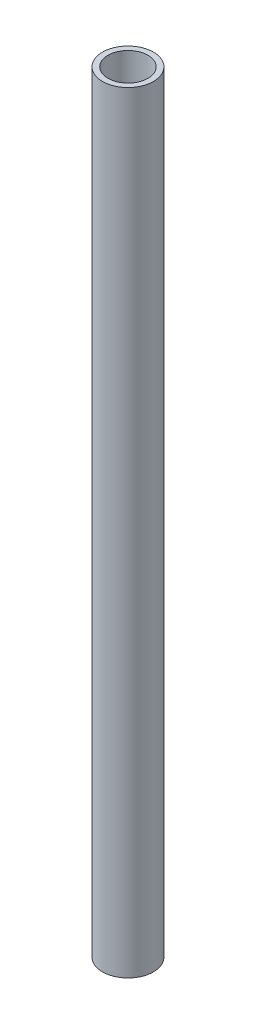
ISO-10303-21;
HEADER;
FILE_DESCRIPTION(('STEP AP214'),'2;1');
FILE_NAME('part.step','',(''),(''),'','','');
FILE_SCHEMA(('AUTOMOTIVE_DESIGN { 1 0 10303 214 1 1 1 1 }'));
ENDSEC;
DATA;
#1=APPLICATION_CONTEXT('core data for automotive mechanical design processes');
#2=APPLICATION_PROTOCOL_DEFINITION('international standard','automotive_design',2000,#1);
#3=PRODUCT_CONTEXT('',#1,'mechanical');
#4=PRODUCT('Part','Part','',(#3));
#5=PRODUCT_RELATED_PRODUCT_CATEGORY('part','',(#4));
#6=PRODUCT_DEFINITION_FORMATION('','',#4);
#7=PRODUCT_DEFINITION_CONTEXT('part definition',#1,'design');
#8=PRODUCT_DEFINITION('design','',#6,#7);
#9=PRODUCT_DEFINITION_SHAPE('','',#8);
#10=(LENGTH_UNIT() NAMED_UNIT(*) SI_UNIT(.MILLI.,.METRE.));
#11=(NAMED_UNIT(*) PLANE_ANGLE_UNIT() SI_UNIT($,.RADIAN.));
#12=(NAMED_UNIT(*) SI_UNIT($,.STERADIAN.) SOLID_ANGLE_UNIT());
#13=UNCERTAINTY_MEASURE_WITH_UNIT(LENGTH_MEASURE(1.E-05),#10,'distance_accuracy_value','');
#14=(GEOMETRIC_REPRESENTATION_CONTEXT(3) GLOBAL_UNCERTAINTY_ASSIGNED_CONTEXT((#13)) GLOBAL_UNIT_ASSIGNED_CONTEXT((#10,
#11,#12)) REPRESENTATION_CONTEXT('',''));
#15=CARTESIAN_POINT('',(0.,0.,0.));
#16=DIRECTION('',(0.,0.,1.));
#17=DIRECTION('',(1.,0.,0.));
#18=AXIS2_PLACEMENT_3D('',#15,#16,#17);
#19=CARTESIAN_POINT('',(0.,508.,0.));
#20=DIRECTION('',(0.,1.,0.));
#21=DIRECTION('',(0.,0.,1.));
#22=AXIS2_PLACEMENT_3D('',#19,#20,#21);
#23=PLANE('',#22);
#24=CARTESIAN_POINT('',(0.,508.,0.));
#25=DIRECTION('',(0.,1.,0.));
#26=DIRECTION('',(0.,0.,1.));
#27=AXIS2_PLACEMENT_3D('',#24,#25,#26);
#28=CIRCLE('',#27,16.764);
#29=CARTESIAN_POINT('',(0.,508.,16.764));
#30=VERTEX_POINT('',#29);
#31=EDGE_CURVE('E10',#30,#30,#28,.T.);
#32=ORIENTED_EDGE('',*,*,#31,.T.);
#33=EDGE_LOOP('',(#32));
#34=FACE_BOUND('',#33,.T.);
#35=CARTESIAN_POINT('',(0.,508.,0.));
#36=DIRECTION('',(0.,1.,0.));
#37=DIRECTION('',(0.,0.,1.));
#38=AXIS2_PLACEMENT_3D('',#35,#36,#37);
#39=CIRCLE('',#38,13.17625);
#40=CARTESIAN_POINT('',(0.,508.,13.17625));
#41=VERTEX_POINT('',#40);
#42=EDGE_CURVE('E52',#41,#41,#39,.T.);
#43=ORIENTED_EDGE('',*,*,#42,.F.);
#44=EDGE_LOOP('',(#43));
#45=FACE_BOUND('',#44,.T.);
#46=ADVANCED_FACE('F39',(#34,#45),#23,.T.);
#47=CARTESIAN_POINT('',(0.,0.,0.));
#48=DIRECTION('',(0.,1.,0.));
#49=DIRECTION('',(0.,0.,1.));
#50=AXIS2_PLACEMENT_3D('',#47,#48,#49);
#51=PLANE('',#50);
#52=CARTESIAN_POINT('',(0.,0.,0.));
#53=DIRECTION('',(0.,1.,0.));
#54=DIRECTION('',(0.,0.,1.));
#55=AXIS2_PLACEMENT_3D('',#52,#53,#54);
#56=CIRCLE('',#55,16.764);
#57=CARTESIAN_POINT('',(0.,0.,16.764));
#58=VERTEX_POINT('',#57);
#59=EDGE_CURVE('E43',#58,#58,#56,.T.);
#60=ORIENTED_EDGE('',*,*,#59,.F.);
#61=EDGE_LOOP('',(#60));
#62=FACE_BOUND('',#61,.T.);
#63=CARTESIAN_POINT('',(0.,0.,0.));
#64=DIRECTION('',(0.,1.,0.));
#65=DIRECTION('',(0.,0.,1.));
#66=AXIS2_PLACEMENT_3D('',#63,#64,#65);
#67=CIRCLE('',#66,13.17625);
#68=CARTESIAN_POINT('',(0.,0.,13.17625));
#69=VERTEX_POINT('',#68);
#70=EDGE_CURVE('E54',#69,#69,#67,.T.);
#71=ORIENTED_EDGE('',*,*,#70,.T.);
#72=EDGE_LOOP('',(#71));
#73=FACE_BOUND('',#72,.T.);
#74=ADVANCED_FACE('F66',(#62,#73),#51,.F.);
#75=CARTESIAN_POINT('',(0.,508.,0.));
#76=DIRECTION('',(0.,-1.,0.));
#77=DIRECTION('',(0.,0.,-1.));
#78=AXIS2_PLACEMENT_3D('',#75,#76,#77);
#79=CYLINDRICAL_SURFACE('',#78,16.764);
#80=ORIENTED_EDGE('',*,*,#31,.F.);
#81=EDGE_LOOP('',(#80));
#82=FACE_BOUND('',#81,.T.);
#83=ORIENTED_EDGE('',*,*,#59,.T.);
#84=EDGE_LOOP('',(#83));
#85=FACE_BOUND('',#84,.T.);
#86=ADVANCED_FACE('F41',(#82,#85),#79,.T.);
#87=CARTESIAN_POINT('',(0.,508.,0.));
#88=DIRECTION('',(0.,-1.,0.));
#89=DIRECTION('',(0.,0.,-1.));
#90=AXIS2_PLACEMENT_3D('',#87,#88,#89);
#91=CYLINDRICAL_SURFACE('',#90,13.17625);
#92=ORIENTED_EDGE('',*,*,#42,.T.);
#93=EDGE_LOOP('',(#92));
#94=FACE_BOUND('',#93,.T.);
#95=ORIENTED_EDGE('',*,*,#70,.F.);
#96=EDGE_LOOP('',(#95));
#97=FACE_BOUND('',#96,.T.);
#98=ADVANCED_FACE('F62',(#94,#97),#91,.F.);
#99=CLOSED_SHELL('',(#46,#74,#86,#98));
#100=MANIFOLD_SOLID_BREP('B2',#99);
#101=ADVANCED_BREP_SHAPE_REPRESENTATION('',(#18,#100),#14);
#102=SHAPE_DEFINITION_REPRESENTATION(#9,#101);
ENDSEC;
END-ISO-10303-21;
